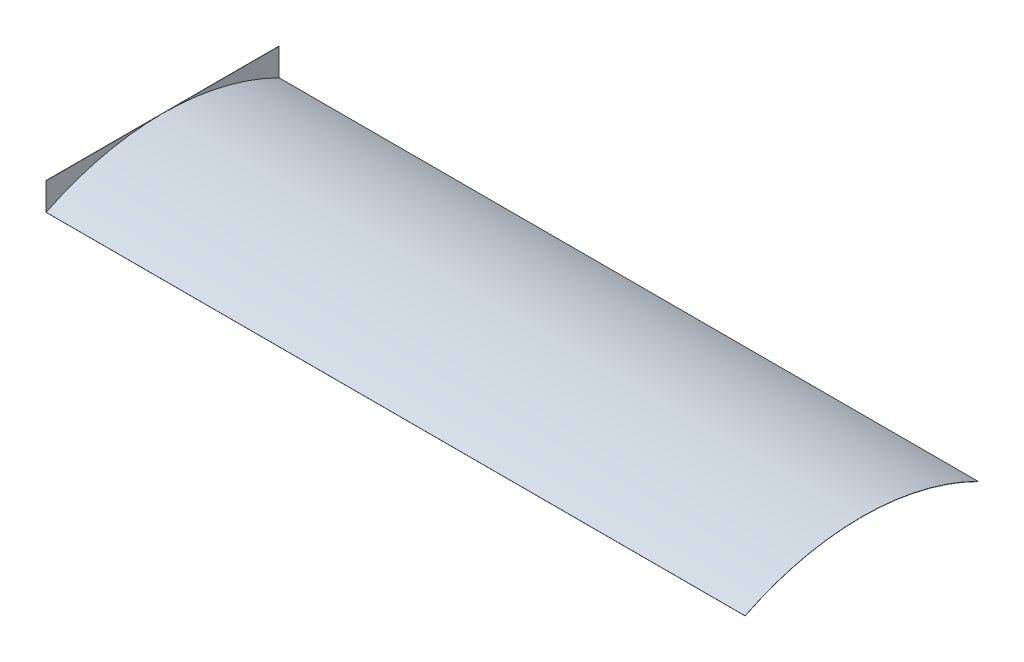
ISO-10303-21;
HEADER;
FILE_DESCRIPTION(('STEP AP214'),'2;1');
FILE_NAME('part.step','',(''),(''),'','','');
FILE_SCHEMA(('AUTOMOTIVE_DESIGN { 1 0 10303 214 1 1 1 1 }'));
ENDSEC;
DATA;
#1=APPLICATION_CONTEXT('core data for automotive mechanical design processes');
#2=APPLICATION_PROTOCOL_DEFINITION('international standard','automotive_design',2000,#1);
#3=PRODUCT_CONTEXT('',#1,'mechanical');
#4=PRODUCT('Part','Part','',(#3));
#5=PRODUCT_RELATED_PRODUCT_CATEGORY('part','',(#4));
#6=PRODUCT_DEFINITION_FORMATION('','',#4);
#7=PRODUCT_DEFINITION_CONTEXT('part definition',#1,'design');
#8=PRODUCT_DEFINITION('design','',#6,#7);
#9=PRODUCT_DEFINITION_SHAPE('','',#8);
#10=(LENGTH_UNIT() NAMED_UNIT(*) SI_UNIT(.MILLI.,.METRE.));
#11=(NAMED_UNIT(*) PLANE_ANGLE_UNIT() SI_UNIT($,.RADIAN.));
#12=(NAMED_UNIT(*) SI_UNIT($,.STERADIAN.) SOLID_ANGLE_UNIT());
#13=UNCERTAINTY_MEASURE_WITH_UNIT(LENGTH_MEASURE(1.E-05),#10,'distance_accuracy_value','');
#14=(GEOMETRIC_REPRESENTATION_CONTEXT(3) GLOBAL_UNCERTAINTY_ASSIGNED_CONTEXT((#13)) GLOBAL_UNIT_ASSIGNED_CONTEXT((#10,
#11,#12)) REPRESENTATION_CONTEXT('',''));
#15=CARTESIAN_POINT('',(0.,0.,0.));
#16=DIRECTION('',(0.,0.,1.));
#17=DIRECTION('',(1.,0.,0.));
#18=AXIS2_PLACEMENT_3D('',#15,#16,#17);
#19=CARTESIAN_POINT('',(0.,304.8,0.));
#20=DIRECTION('',(1.,0.,0.));
#21=DIRECTION('',(0.,0.,-1.));
#22=AXIS2_PLACEMENT_3D('',#19,#20,#21);
#23=PLANE('',#22);
#24=DIRECTION('',(0.,-1.,0.));
#25=VECTOR('',#24,1.);
#26=CARTESIAN_POINT('',(0.,304.8,2590.8));
#27=LINE('',#26,#25);
#28=CARTESIAN_POINT('',(0.,304.8,2590.8));
#29=VERTEX_POINT('',#28);
#30=CARTESIAN_POINT('',(0.,0.,2590.8));
#31=VERTEX_POINT('',#30);
#32=EDGE_CURVE('E176',#29,#31,#27,.T.);
#33=ORIENTED_EDGE('',*,*,#32,.T.);
#34=CARTESIAN_POINT('',(0.,-2600.32500000001,1295.4));
#35=DIRECTION('',(-1.,0.,0.));
#36=DIRECTION('',(0.,0.,1.));
#37=AXIS2_PLACEMENT_3D('',#34,#35,#36);
#38=CIRCLE('',#37,2905.12500000001);
#39=CARTESIAN_POINT('',(0.,304.799999999998,1295.4));
#40=VERTEX_POINT('',#39);
#41=EDGE_CURVE('E142',#31,#40,#38,.T.);
#42=ORIENTED_EDGE('',*,*,#41,.T.);
#43=DIRECTION('',(0.,0.,1.));
#44=VECTOR('',#43,1.);
#45=CARTESIAN_POINT('',(0.,304.8,0.));
#46=LINE('',#45,#44);
#47=EDGE_CURVE('E156',#40,#29,#46,.T.);
#48=ORIENTED_EDGE('',*,*,#47,.T.);
#49=EDGE_LOOP('',(#33,#42,#48));
#50=FACE_BOUND('',#49,.T.);
#51=ADVANCED_FACE('F33',(#50),#23,.T.);
#52=CARTESIAN_POINT('',(0.,304.8,0.));
#53=VERTEX_POINT('',#52);
#54=EDGE_CURVE('E157',#53,#40,#46,.T.);
#55=ORIENTED_EDGE('',*,*,#54,.T.);
#56=CARTESIAN_POINT('',(0.,0.,0.));
#57=VERTEX_POINT('',#56);
#58=EDGE_CURVE('E43',#40,#57,#38,.T.);
#59=ORIENTED_EDGE('',*,*,#58,.T.);
#60=DIRECTION('',(0.,-1.,0.));
#61=VECTOR('',#60,1.);
#62=CARTESIAN_POINT('',(0.,304.8,0.));
#63=LINE('',#62,#61);
#64=EDGE_CURVE('E174',#53,#57,#63,.T.);
#65=ORIENTED_EDGE('',*,*,#64,.F.);
#66=EDGE_LOOP('',(#55,#59,#65));
#67=FACE_BOUND('',#66,.T.);
#68=ADVANCED_FACE('F184',(#67),#23,.T.);
#69=CARTESIAN_POINT('',(-2.54,304.8,0.));
#70=DIRECTION('',(1.,0.,0.));
#71=DIRECTION('',(0.,0.,-1.));
#72=AXIS2_PLACEMENT_3D('',#69,#70,#71);
#73=PLANE('',#72);
#74=DIRECTION('',(0.,0.,-1.));
#75=VECTOR('',#74,1.);
#76=CARTESIAN_POINT('',(-2.54,0.,0.));
#77=LINE('',#76,#75);
#78=CARTESIAN_POINT('',(-2.54,0.,0.));
#79=VERTEX_POINT('',#78);
#80=CARTESIAN_POINT('',(-2.54,0.,2590.8));
#81=VERTEX_POINT('',#80);
#82=EDGE_CURVE('E131',#79,#81,#77,.F.);
#83=ORIENTED_EDGE('',*,*,#82,.T.);
#84=DIRECTION('',(0.,-1.,0.));
#85=VECTOR('',#84,1.);
#86=CARTESIAN_POINT('',(-2.54,304.8,2590.8));
#87=LINE('',#86,#85);
#88=CARTESIAN_POINT('',(-2.54,304.8,2590.8));
#89=VERTEX_POINT('',#88);
#90=EDGE_CURVE('E37',#89,#81,#87,.T.);
#91=ORIENTED_EDGE('',*,*,#90,.F.);
#92=DIRECTION('',(0.,0.,-1.));
#93=VECTOR('',#92,1.);
#94=CARTESIAN_POINT('',(-2.54,304.8,0.));
#95=LINE('',#94,#93);
#96=CARTESIAN_POINT('',(-2.54,304.8,0.));
#97=VERTEX_POINT('',#96);
#98=EDGE_CURVE('E81',#97,#89,#95,.F.);
#99=ORIENTED_EDGE('',*,*,#98,.F.);
#100=DIRECTION('',(0.,-1.,0.));
#101=VECTOR('',#100,1.);
#102=CARTESIAN_POINT('',(-2.54,304.8,0.));
#103=LINE('',#102,#101);
#104=EDGE_CURVE('E54',#97,#79,#103,.T.);
#105=ORIENTED_EDGE('',*,*,#104,.T.);
#106=EDGE_LOOP('',(#83,#91,#99,#105));
#107=FACE_BOUND('',#106,.T.);
#108=ADVANCED_FACE('F35',(#107),#73,.F.);
#109=CARTESIAN_POINT('',(0.,304.8,2590.8));
#110=DIRECTION('',(0.,0.,1.));
#111=DIRECTION('',(1.,0.,0.));
#112=AXIS2_PLACEMENT_3D('',#109,#110,#111);
#113=PLANE('',#112);
#114=DIRECTION('',(-1.,0.,0.));
#115=VECTOR('',#114,1.);
#116=CARTESIAN_POINT('',(0.,0.,2590.8));
#117=LINE('',#116,#115);
#118=EDGE_CURVE('E163',#31,#81,#117,.T.);
#119=ORIENTED_EDGE('',*,*,#118,.F.);
#120=ORIENTED_EDGE('',*,*,#32,.F.);
#121=DIRECTION('',(-1.,0.,0.));
#122=VECTOR('',#121,1.);
#123=CARTESIAN_POINT('',(0.,304.8,2590.8));
#124=LINE('',#123,#122);
#125=EDGE_CURVE('E152',#29,#89,#124,.T.);
#126=ORIENTED_EDGE('',*,*,#125,.T.);
#127=ORIENTED_EDGE('',*,*,#90,.T.);
#128=EDGE_LOOP('',(#119,#120,#126,#127));
#129=FACE_BOUND('',#128,.T.);
#130=ADVANCED_FACE('F194',(#129),#113,.T.);
#131=CARTESIAN_POINT('',(0.,-2600.32500000001,1295.4));
#132=DIRECTION('',(1.,0.,0.));
#133=DIRECTION('',(0.,0.,-1.));
#134=AXIS2_PLACEMENT_3D('',#131,#132,#133);
#135=CIRCLE('',#134,2902.58500000001);
#136=CARTESIAN_POINT('',(0.,0.,2585.09359795263));
#137=VERTEX_POINT('',#136);
#138=CARTESIAN_POINT('',(0.,0.,5.70640204737138));
#139=VERTEX_POINT('',#138);
#140=EDGE_CURVE('E11',#137,#139,#135,.F.);
#141=ORIENTED_EDGE('',*,*,#140,.F.);
#142=DIRECTION('',(0.,0.,1.));
#143=VECTOR('',#142,1.);
#144=CARTESIAN_POINT('',(0.,0.,0.));
#145=LINE('',#144,#143);
#146=EDGE_CURVE('E170',#139,#137,#145,.T.);
#147=ORIENTED_EDGE('',*,*,#146,.F.);
#148=EDGE_LOOP('',(#141,#147));
#149=FACE_BOUND('',#148,.T.);
#150=ADVANCED_FACE('F206',(#149),#23,.T.);
#151=CARTESIAN_POINT('',(-2.54,304.8,0.));
#152=DIRECTION('',(0.,0.,-1.));
#153=DIRECTION('',(-1.,0.,0.));
#154=AXIS2_PLACEMENT_3D('',#151,#152,#153);
#155=PLANE('',#154);
#156=DIRECTION('',(1.,0.,0.));
#157=VECTOR('',#156,1.);
#158=CARTESIAN_POINT('',(-2.54,0.,0.));
#159=LINE('',#158,#157);
#160=EDGE_CURVE('E153',#79,#57,#159,.T.);
#161=ORIENTED_EDGE('',*,*,#160,.F.);
#162=ORIENTED_EDGE('',*,*,#104,.F.);
#163=DIRECTION('',(1.,0.,0.));
#164=VECTOR('',#163,1.);
#165=CARTESIAN_POINT('',(-2.54,304.8,0.));
#166=LINE('',#165,#164);
#167=EDGE_CURVE('E160',#97,#53,#166,.T.);
#168=ORIENTED_EDGE('',*,*,#167,.T.);
#169=ORIENTED_EDGE('',*,*,#64,.T.);
#170=EDGE_LOOP('',(#161,#162,#168,#169));
#171=FACE_BOUND('',#170,.T.);
#172=ADVANCED_FACE('F188',(#171),#155,.T.);
#173=CARTESIAN_POINT('',(0.,304.8,0.));
#174=DIRECTION('',(0.,1.,0.));
#175=DIRECTION('',(1.,0.,0.));
#176=AXIS2_PLACEMENT_3D('',#173,#174,#175);
#177=PLANE('',#176);
#178=ORIENTED_EDGE('',*,*,#98,.T.);
#179=ORIENTED_EDGE('',*,*,#125,.F.);
#180=ORIENTED_EDGE('',*,*,#47,.F.);
#181=ORIENTED_EDGE('',*,*,#54,.F.);
#182=ORIENTED_EDGE('',*,*,#167,.F.);
#183=EDGE_LOOP('',(#178,#179,#180,#181,#182));
#184=FACE_BOUND('',#183,.T.);
#185=ADVANCED_FACE('F196',(#184),#177,.T.);
#186=CARTESIAN_POINT('',(0.,0.,0.));
#187=DIRECTION('',(0.,1.,0.));
#188=DIRECTION('',(1.,0.,0.));
#189=AXIS2_PLACEMENT_3D('',#186,#187,#188);
#190=PLANE('',#189);
#191=ORIENTED_EDGE('',*,*,#82,.F.);
#192=ORIENTED_EDGE('',*,*,#160,.T.);
#193=EDGE_CURVE('E167',#57,#139,#145,.T.);
#194=ORIENTED_EDGE('',*,*,#193,.T.);
#195=ORIENTED_EDGE('',*,*,#146,.T.);
#196=EDGE_CURVE('E166',#137,#31,#145,.T.);
#197=ORIENTED_EDGE('',*,*,#196,.T.);
#198=ORIENTED_EDGE('',*,*,#118,.T.);
#199=EDGE_LOOP('',(#191,#192,#194,#195,#197,#198));
#200=FACE_BOUND('',#199,.T.);
#201=ADVANCED_FACE('F190',(#200),#190,.F.);
#202=CARTESIAN_POINT('',(0.,-2600.32500000001,1295.4));
#203=DIRECTION('',(1.,0.,0.));
#204=DIRECTION('',(0.,0.,-1.));
#205=AXIS2_PLACEMENT_3D('',#202,#203,#204);
#206=PLANE('',#205);
#207=ORIENTED_EDGE('',*,*,#193,.F.);
#208=DIRECTION('',(0.,-0.895081967213067,0.445901639344358));
#209=VECTOR('',#208,1.);
#210=CARTESIAN_POINT('',(0.,0.,6.66133814775094E-13));
#211=LINE('',#210,#209);
#212=CARTESIAN_POINT('',(0.,-2.27350819672134,1.13259016393541));
#213=VERTEX_POINT('',#212);
#214=EDGE_CURVE('E70',#57,#213,#211,.T.);
#215=ORIENTED_EDGE('',*,*,#214,.T.);
#216=EDGE_CURVE('E46',#139,#213,#135,.F.);
#217=ORIENTED_EDGE('',*,*,#216,.F.);
#218=EDGE_LOOP('',(#207,#215,#217));
#219=FACE_BOUND('',#218,.T.);
#220=ADVANCED_FACE('F270',(#219),#206,.F.);
#221=CARTESIAN_POINT('',(7772.4,-2600.32500000001,1295.4));
#222=DIRECTION('',(-1.,0.,0.));
#223=DIRECTION('',(0.,0.,1.));
#224=AXIS2_PLACEMENT_3D('',#221,#222,#223);
#225=CYLINDRICAL_SURFACE('',#224,2902.58500000001);
#226=CARTESIAN_POINT('',(0.,-2.27350819672179,2589.66740983606));
#227=VERTEX_POINT('',#226);
#228=EDGE_CURVE('E45',#227,#137,#135,.F.);
#229=ORIENTED_EDGE('',*,*,#228,.T.);
#230=ORIENTED_EDGE('',*,*,#140,.T.);
#231=ORIENTED_EDGE('',*,*,#216,.T.);
#232=DIRECTION('',(-1.,0.,0.));
#233=VECTOR('',#232,1.);
#234=CARTESIAN_POINT('',(7772.4,-2.27350819672134,1.13259016393541));
#235=LINE('',#234,#233);
#236=CARTESIAN_POINT('',(7772.4,-2.27350819672134,1.13259016393541));
#237=VERTEX_POINT('',#236);
#238=EDGE_CURVE('E128',#237,#213,#235,.T.);
#239=ORIENTED_EDGE('',*,*,#238,.F.);
#240=CARTESIAN_POINT('',(7772.4,-2600.32500000001,1295.4));
#241=DIRECTION('',(1.,0.,0.));
#242=DIRECTION('',(0.,0.,-1.));
#243=AXIS2_PLACEMENT_3D('',#240,#241,#242);
#244=CIRCLE('',#243,2902.58500000001);
#245=CARTESIAN_POINT('',(7772.4,-2.27350819672179,2589.66740983606));
#246=VERTEX_POINT('',#245);
#247=EDGE_CURVE('E116',#246,#237,#244,.F.);
#248=ORIENTED_EDGE('',*,*,#247,.F.);
#249=DIRECTION('',(-1.,0.,0.));
#250=VECTOR('',#249,1.);
#251=CARTESIAN_POINT('',(7772.4,-2.27350819672179,2589.66740983606));
#252=LINE('',#251,#250);
#253=EDGE_CURVE('E139',#246,#227,#252,.T.);
#254=ORIENTED_EDGE('',*,*,#253,.T.);
#255=EDGE_LOOP('',(#229,#230,#231,#239,#248,#254));
#256=FACE_BOUND('',#255,.T.);
#257=ADVANCED_FACE('F130',(#256),#225,.F.);
#258=CARTESIAN_POINT('',(7772.4,0.,6.66133814775094E-13));
#259=DIRECTION('',(0.,-0.445901639344358,-0.895081967213067));
#260=DIRECTION('',(0.,0.895081967213067,-0.445901639344358));
#261=AXIS2_PLACEMENT_3D('',#258,#259,#260);
#262=PLANE('',#261);
#263=ORIENTED_EDGE('',*,*,#214,.F.);
#264=DIRECTION('',(-1.,0.,0.));
#265=VECTOR('',#264,1.);
#266=CARTESIAN_POINT('',(7772.4,0.,6.66133814775094E-13));
#267=LINE('',#266,#265);
#268=CARTESIAN_POINT('',(7772.4,0.,6.66133814775094E-13));
#269=VERTEX_POINT('',#268);
#270=EDGE_CURVE('E132',#269,#57,#267,.T.);
#271=ORIENTED_EDGE('',*,*,#270,.F.);
#272=DIRECTION('',(0.,-0.895081967213067,0.445901639344358));
#273=VECTOR('',#272,1.);
#274=CARTESIAN_POINT('',(7772.4,0.,6.66133814775094E-13));
#275=LINE('',#274,#273);
#276=EDGE_CURVE('E121',#269,#237,#275,.T.);
#277=ORIENTED_EDGE('',*,*,#276,.T.);
#278=ORIENTED_EDGE('',*,*,#238,.T.);
#279=EDGE_LOOP('',(#263,#271,#277,#278));
#280=FACE_BOUND('',#279,.T.);
#281=ADVANCED_FACE('F134',(#280),#262,.T.);
#282=CARTESIAN_POINT('',(7772.4,-2600.32500000001,1295.4));
#283=DIRECTION('',(-1.,0.,0.));
#284=DIRECTION('',(0.,0.,1.));
#285=AXIS2_PLACEMENT_3D('',#282,#283,#284);
#286=CYLINDRICAL_SURFACE('',#285,2905.12500000001);
#287=ORIENTED_EDGE('',*,*,#41,.F.);
#288=DIRECTION('',(-1.,0.,0.));
#289=VECTOR('',#288,1.);
#290=CARTESIAN_POINT('',(7772.4,0.,2590.8));
#291=LINE('',#290,#289);
#292=CARTESIAN_POINT('',(7772.4,0.,2590.8));
#293=VERTEX_POINT('',#292);
#294=EDGE_CURVE('E148',#293,#31,#291,.T.);
#295=ORIENTED_EDGE('',*,*,#294,.F.);
#296=CARTESIAN_POINT('',(7772.4,-2600.32500000001,1295.4));
#297=DIRECTION('',(-1.,0.,0.));
#298=DIRECTION('',(0.,0.,1.));
#299=AXIS2_PLACEMENT_3D('',#296,#297,#298);
#300=CIRCLE('',#299,2905.12500000001);
#301=EDGE_CURVE('E135',#293,#269,#300,.T.);
#302=ORIENTED_EDGE('',*,*,#301,.T.);
#303=ORIENTED_EDGE('',*,*,#270,.T.);
#304=ORIENTED_EDGE('',*,*,#58,.F.);
#305=EDGE_LOOP('',(#287,#295,#302,#303,#304));
#306=FACE_BOUND('',#305,.T.);
#307=ADVANCED_FACE('F197',(#306),#286,.T.);
#308=CARTESIAN_POINT('',(7772.4,-2.27350819672179,2589.66740983606));
#309=DIRECTION('',(0.,-0.445901639344288,0.895081967213102));
#310=DIRECTION('',(0.,-0.895081967213102,-0.445901639344288));
#311=AXIS2_PLACEMENT_3D('',#308,#309,#310);
#312=PLANE('',#311);
#313=DIRECTION('',(0.,0.895081967213102,0.445901639344288));
#314=VECTOR('',#313,1.);
#315=CARTESIAN_POINT('',(0.,-2.27350819672179,2589.66740983606));
#316=LINE('',#315,#314);
#317=EDGE_CURVE('E126',#227,#31,#316,.T.);
#318=ORIENTED_EDGE('',*,*,#317,.F.);
#319=ORIENTED_EDGE('',*,*,#253,.F.);
#320=DIRECTION('',(0.,0.895081967213102,0.445901639344288));
#321=VECTOR('',#320,1.);
#322=CARTESIAN_POINT('',(7772.4,-2.27350819672179,2589.66740983606));
#323=LINE('',#322,#321);
#324=EDGE_CURVE('E124',#246,#293,#323,.T.);
#325=ORIENTED_EDGE('',*,*,#324,.T.);
#326=ORIENTED_EDGE('',*,*,#294,.T.);
#327=EDGE_LOOP('',(#318,#319,#325,#326));
#328=FACE_BOUND('',#327,.T.);
#329=ADVANCED_FACE('F207',(#328),#312,.T.);
#330=CARTESIAN_POINT('',(7772.4,-2600.32500000001,1295.4));
#331=DIRECTION('',(1.,0.,0.));
#332=DIRECTION('',(0.,0.,-1.));
#333=AXIS2_PLACEMENT_3D('',#330,#331,#332);
#334=PLANE('',#333);
#335=ORIENTED_EDGE('',*,*,#247,.T.);
#336=ORIENTED_EDGE('',*,*,#276,.F.);
#337=ORIENTED_EDGE('',*,*,#301,.F.);
#338=ORIENTED_EDGE('',*,*,#324,.F.);
#339=EDGE_LOOP('',(#335,#336,#337,#338));
#340=FACE_BOUND('',#339,.T.);
#341=ADVANCED_FACE('F118',(#340),#334,.T.);
#342=ORIENTED_EDGE('',*,*,#196,.F.);
#343=ORIENTED_EDGE('',*,*,#228,.F.);
#344=ORIENTED_EDGE('',*,*,#317,.T.);
#345=EDGE_LOOP('',(#342,#343,#344));
#346=FACE_BOUND('',#345,.T.);
#347=ADVANCED_FACE('F201',(#346),#206,.F.);
#348=CLOSED_SHELL('',(#51,#68,#108,#130,#150,#172,#185,#201,#220,#257,#281,#307,#329,#341,#347));
#349=MANIFOLD_SOLID_BREP('B2',#348);
#350=ADVANCED_BREP_SHAPE_REPRESENTATION('',(#18,#349),#14);
#351=SHAPE_DEFINITION_REPRESENTATION(#9,#350);
ENDSEC;
END-ISO-10303-21;
